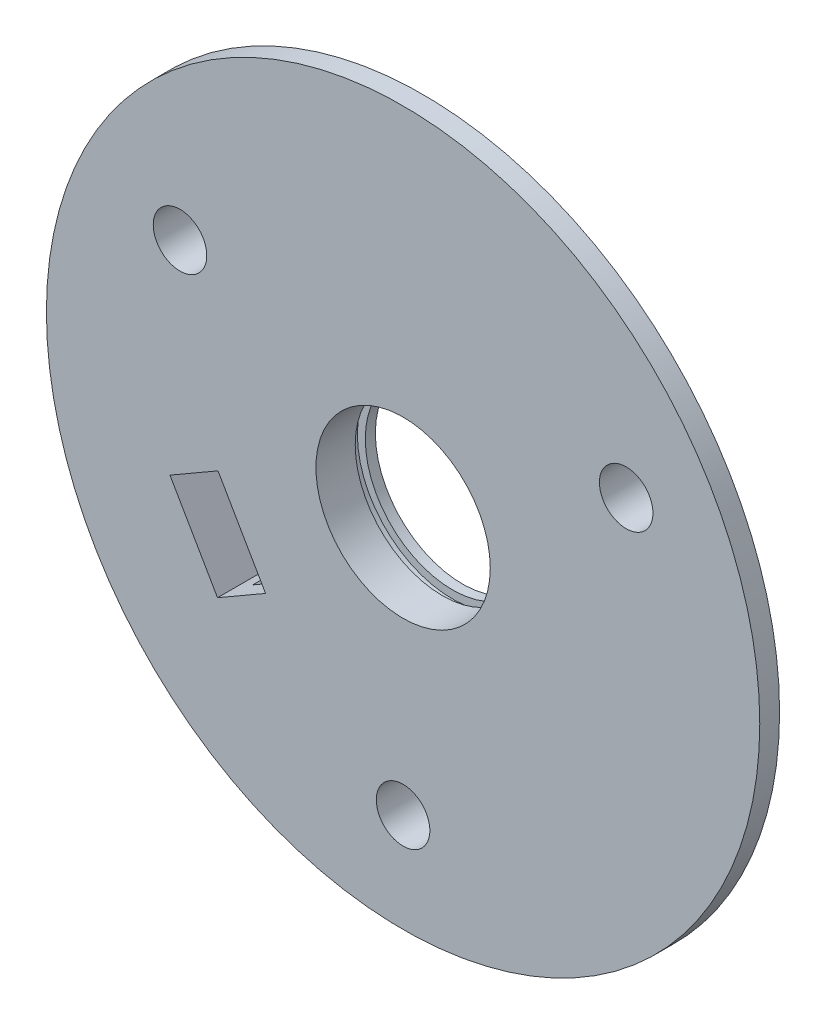
ISO-10303-21;
HEADER;
FILE_DESCRIPTION(('STEP AP214'),'2;1');
FILE_NAME('part.step','',(''),(''),'','','');
FILE_SCHEMA(('AUTOMOTIVE_DESIGN { 1 0 10303 214 1 1 1 1 }'));
ENDSEC;
DATA;
#1=APPLICATION_CONTEXT('core data for automotive mechanical design processes');
#2=APPLICATION_PROTOCOL_DEFINITION('international standard','automotive_design',2000,#1);
#3=PRODUCT_CONTEXT('',#1,'mechanical');
#4=PRODUCT('Part','Part','',(#3));
#5=PRODUCT_RELATED_PRODUCT_CATEGORY('part','',(#4));
#6=PRODUCT_DEFINITION_FORMATION('','',#4);
#7=PRODUCT_DEFINITION_CONTEXT('part definition',#1,'design');
#8=PRODUCT_DEFINITION('design','',#6,#7);
#9=PRODUCT_DEFINITION_SHAPE('','',#8);
#10=(LENGTH_UNIT() NAMED_UNIT(*) SI_UNIT(.MILLI.,.METRE.));
#11=(NAMED_UNIT(*) PLANE_ANGLE_UNIT() SI_UNIT($,.RADIAN.));
#12=(NAMED_UNIT(*) SI_UNIT($,.STERADIAN.) SOLID_ANGLE_UNIT());
#13=UNCERTAINTY_MEASURE_WITH_UNIT(LENGTH_MEASURE(1.E-05),#10,'distance_accuracy_value','');
#14=(GEOMETRIC_REPRESENTATION_CONTEXT(3) GLOBAL_UNCERTAINTY_ASSIGNED_CONTEXT((#13)) GLOBAL_UNIT_ASSIGNED_CONTEXT((#10,
#11,#12)) REPRESENTATION_CONTEXT('',''));
#15=CARTESIAN_POINT('',(0.,0.,0.));
#16=DIRECTION('',(0.,0.,1.));
#17=DIRECTION('',(1.,0.,0.));
#18=AXIS2_PLACEMENT_3D('',#15,#16,#17);
#19=CARTESIAN_POINT('',(0.,0.,2.5));
#20=DIRECTION('',(0.,0.,1.));
#21=DIRECTION('',(1.,0.,0.));
#22=AXIS2_PLACEMENT_3D('',#19,#20,#21);
#23=PLANE('',#22);
#24=DIRECTION('',(0.866025403784441,0.499999999999996,0.));
#25=VECTOR('',#24,1.);
#26=CARTESIAN_POINT('',(-23.4137748154249,-20.4461524227058,2.5));
#27=LINE('',#26,#25);
#28=CARTESIAN_POINT('',(-23.4137748154249,-20.4461524227058,2.5));
#29=VERTEX_POINT('',#28);
#30=CARTESIAN_POINT('',(-17.3515969889346,-16.9461524227063,2.5));
#31=VERTEX_POINT('',#30);
#32=EDGE_CURVE('E177',#29,#31,#27,.T.);
#33=ORIENTED_EDGE('',*,*,#32,.F.);
#34=DIRECTION('',(0.499999999999995,-0.866025403784441,0.));
#35=VECTOR('',#34,1.);
#36=CARTESIAN_POINT('',(-29.4137748154248,-10.0538475772925,2.5));
#37=LINE('',#36,#35);
#38=CARTESIAN_POINT('',(-29.4137748154248,-10.0538475772925,2.5));
#39=VERTEX_POINT('',#38);
#40=EDGE_CURVE('E174',#39,#29,#37,.T.);
#41=ORIENTED_EDGE('',*,*,#40,.F.);
#42=DIRECTION('',(-0.866025403784441,-0.499999999999996,0.));
#43=VECTOR('',#42,1.);
#44=CARTESIAN_POINT('',(-23.3515969889337,-6.55384757729253,2.5));
#45=LINE('',#44,#43);
#46=CARTESIAN_POINT('',(-23.3515969889337,-6.55384757729253,2.5));
#47=VERTEX_POINT('',#46);
#48=EDGE_CURVE('E185',#47,#39,#45,.T.);
#49=ORIENTED_EDGE('',*,*,#48,.F.);
#50=DIRECTION('',(-0.49999999999993,0.866025403784479,0.));
#51=VECTOR('',#50,1.);
#52=CARTESIAN_POINT('',(-17.3515969889346,-16.9461524227063,2.5));
#53=LINE('',#52,#51);
#54=EDGE_CURVE('E181',#31,#47,#53,.T.);
#55=ORIENTED_EDGE('',*,*,#54,.F.);
#56=EDGE_LOOP('',(#33,#41,#49,#55));
#57=FACE_BOUND('',#56,.T.);
#58=CARTESIAN_POINT('',(0.,0.,2.5));
#59=DIRECTION('',(0.,0.,1.));
#60=DIRECTION('',(1.,0.,0.));
#61=AXIS2_PLACEMENT_3D('',#58,#59,#60);
#62=CIRCLE('',#61,45.);
#63=CARTESIAN_POINT('',(45.,0.,2.5));
#64=VERTEX_POINT('',#63);
#65=EDGE_CURVE('E245',#64,#64,#62,.T.);
#66=ORIENTED_EDGE('',*,*,#65,.T.);
#67=EDGE_LOOP('',(#66));
#68=FACE_BOUND('',#67,.T.);
#69=CARTESIAN_POINT('',(0.,0.,2.5));
#70=DIRECTION('',(0.,0.,1.));
#71=DIRECTION('',(1.,0.,0.));
#72=AXIS2_PLACEMENT_3D('',#69,#70,#71);
#73=CIRCLE('',#72,11.);
#74=CARTESIAN_POINT('',(11.,0.,2.5));
#75=VERTEX_POINT('',#74);
#76=EDGE_CURVE('E241',#75,#75,#73,.T.);
#77=ORIENTED_EDGE('',*,*,#76,.F.);
#78=EDGE_LOOP('',(#77));
#79=FACE_BOUND('',#78,.T.);
#80=CARTESIAN_POINT('',(0.,-32.5,2.5));
#81=DIRECTION('',(0.,0.,-1.));
#82=DIRECTION('',(-1.,0.,0.));
#83=AXIS2_PLACEMENT_3D('',#80,#81,#82);
#84=CIRCLE('',#83,3.3782);
#85=CARTESIAN_POINT('',(-3.3782,-32.5,2.5));
#86=VERTEX_POINT('',#85);
#87=EDGE_CURVE('E377',#86,#86,#84,.T.);
#88=ORIENTED_EDGE('',*,*,#87,.T.);
#89=EDGE_LOOP('',(#88));
#90=FACE_BOUND('',#89,.T.);
#91=CARTESIAN_POINT('',(-28.1458256229944,16.2499999999997,2.5));
#92=DIRECTION('',(0.,0.,-1.));
#93=DIRECTION('',(-1.,0.,0.));
#94=AXIS2_PLACEMENT_3D('',#91,#92,#93);
#95=CIRCLE('',#94,3.3782);
#96=CARTESIAN_POINT('',(-31.5240256229944,16.2499999999997,2.5));
#97=VERTEX_POINT('',#96);
#98=EDGE_CURVE('E381',#97,#97,#95,.T.);
#99=ORIENTED_EDGE('',*,*,#98,.T.);
#100=EDGE_LOOP('',(#99));
#101=FACE_BOUND('',#100,.T.);
#102=CARTESIAN_POINT('',(28.1458256229942,16.2500000000001,2.5));
#103=DIRECTION('',(0.,0.,-1.));
#104=DIRECTION('',(-1.,0.,0.));
#105=AXIS2_PLACEMENT_3D('',#102,#103,#104);
#106=CIRCLE('',#105,3.3782);
#107=CARTESIAN_POINT('',(24.7676256229942,16.2500000000001,2.5));
#108=VERTEX_POINT('',#107);
#109=EDGE_CURVE('E384',#108,#108,#106,.T.);
#110=ORIENTED_EDGE('',*,*,#109,.T.);
#111=EDGE_LOOP('',(#110));
#112=FACE_BOUND('',#111,.T.);
#113=ADVANCED_FACE('F46',(#57,#68,#79,#90,#101,#112),#23,.T.);
#114=CARTESIAN_POINT('',(0.,0.,-3.));
#115=DIRECTION('',(0.,0.,-1.));
#116=DIRECTION('',(-1.,0.,0.));
#117=AXIS2_PLACEMENT_3D('',#114,#115,#116);
#118=PLANE('',#117);
#119=CARTESIAN_POINT('',(28.1458256229942,16.2500000000001,-3.));
#120=DIRECTION('',(0.,0.,-1.));
#121=DIRECTION('',(-1.,0.,0.));
#122=AXIS2_PLACEMENT_3D('',#119,#120,#121);
#123=CIRCLE('',#122,3.37819999999999);
#124=CARTESIAN_POINT('',(24.7676256229942,16.2500000000001,-3.));
#125=VERTEX_POINT('',#124);
#126=EDGE_CURVE('E387',#125,#125,#123,.T.);
#127=ORIENTED_EDGE('',*,*,#126,.F.);
#128=EDGE_LOOP('',(#127));
#129=FACE_BOUND('',#128,.T.);
#130=CARTESIAN_POINT('',(-28.1458256229944,16.2499999999997,-3.));
#131=DIRECTION('',(0.,0.,-1.));
#132=DIRECTION('',(-1.,0.,0.));
#133=AXIS2_PLACEMENT_3D('',#130,#131,#132);
#134=CIRCLE('',#133,3.37819999999999);
#135=CARTESIAN_POINT('',(-31.5240256229944,16.2499999999997,-3.));
#136=VERTEX_POINT('',#135);
#137=EDGE_CURVE('E386',#136,#136,#134,.T.);
#138=ORIENTED_EDGE('',*,*,#137,.F.);
#139=EDGE_LOOP('',(#138));
#140=FACE_BOUND('',#139,.T.);
#141=CARTESIAN_POINT('',(0.,-32.5,-3.));
#142=DIRECTION('',(0.,0.,-1.));
#143=DIRECTION('',(-1.,0.,0.));
#144=AXIS2_PLACEMENT_3D('',#141,#142,#143);
#145=CIRCLE('',#144,3.37819999999999);
#146=CARTESIAN_POINT('',(-3.37819999999999,-32.5,-3.));
#147=VERTEX_POINT('',#146);
#148=EDGE_CURVE('E395',#147,#147,#145,.T.);
#149=ORIENTED_EDGE('',*,*,#148,.F.);
#150=EDGE_LOOP('',(#149));
#151=FACE_BOUND('',#150,.T.);
#152=CARTESIAN_POINT('',(-8.32538774695314,-10.2095684567011,-3.));
#153=DIRECTION('',(0.,0.,1.));
#154=DIRECTION('',(-1.,0.,0.));
#155=AXIS2_PLACEMENT_3D('',#152,#153,#154);
#156=CIRCLE('',#155,13.5);
#157=CARTESIAN_POINT('',(-19.3001541474491,-18.071152422706,-3.));
#158=VERTEX_POINT('',#157);
#159=CARTESIAN_POINT('',(-2.4537604244755,-22.3658011208916,-3.));
#160=VERTEX_POINT('',#159);
#161=EDGE_CURVE('E154',#158,#160,#156,.T.);
#162=ORIENTED_EDGE('',*,*,#161,.F.);
#163=DIRECTION('',(0.866025403784441,0.499999999999996,0.));
#164=VECTOR('',#163,1.);
#165=CARTESIAN_POINT('',(-23.4137748154249,-20.4461524227058,-3.));
#166=LINE('',#165,#164);
#167=CARTESIAN_POINT('',(-17.3515969889346,-16.9461524227063,-3.));
#168=VERTEX_POINT('',#167);
#169=EDGE_CURVE('E159',#158,#168,#166,.T.);
#170=ORIENTED_EDGE('',*,*,#169,.T.);
#171=DIRECTION('',(-0.49999999999993,0.866025403784479,0.));
#172=VECTOR('',#171,1.);
#173=CARTESIAN_POINT('',(-17.3515969889346,-16.9461524227063,-3.));
#174=LINE('',#173,#172);
#175=CARTESIAN_POINT('',(-23.3515969889337,-6.55384757729253,-3.));
#176=VERTEX_POINT('',#175);
#177=EDGE_CURVE('E195',#168,#176,#174,.T.);
#178=ORIENTED_EDGE('',*,*,#177,.T.);
#179=DIRECTION('',(-0.866025403784441,-0.499999999999996,0.));
#180=VECTOR('',#179,1.);
#181=CARTESIAN_POINT('',(-23.3515969889337,-6.55384757729253,-3.));
#182=LINE('',#181,#180);
#183=CARTESIAN_POINT('',(-29.4137748154248,-10.0538475772925,-3.));
#184=VERTEX_POINT('',#183);
#185=EDGE_CURVE('E178',#176,#184,#182,.T.);
#186=ORIENTED_EDGE('',*,*,#185,.T.);
#187=DIRECTION('',(0.499999999999995,-0.866025403784441,0.));
#188=VECTOR('',#187,1.);
#189=CARTESIAN_POINT('',(-29.4137748154248,-10.0538475772925,-3.));
#190=LINE('',#189,#188);
#191=CARTESIAN_POINT('',(-23.4137748154249,-20.4461524227058,-3.));
#192=VERTEX_POINT('',#191);
#193=EDGE_CURVE('E173',#184,#192,#190,.T.);
#194=ORIENTED_EDGE('',*,*,#193,.T.);
#195=CARTESIAN_POINT('',(-21.4652176569102,-19.321152422706,-3.));
#196=VERTEX_POINT('',#195);
#197=EDGE_CURVE('E192',#192,#196,#166,.T.);
#198=ORIENTED_EDGE('',*,*,#197,.T.);
#199=CARTESIAN_POINT('',(-8.52217045866901,-9.08750550559468,-3.));
#200=DIRECTION('',(0.,0.,-1.));
#201=DIRECTION('',(-1.,0.,0.));
#202=AXIS2_PLACEMENT_3D('',#199,#200,#201);
#203=CIRCLE('',#202,16.5);
#204=CARTESIAN_POINT('',(1.1272960815018,-22.4717423344215,-3.));
#205=VERTEX_POINT('',#204);
#206=EDGE_CURVE('E400',#205,#196,#203,.T.);
#207=ORIENTED_EDGE('',*,*,#206,.F.);
#208=CARTESIAN_POINT('',(0.,0.,-3.));
#209=DIRECTION('',(0.,0.,-1.));
#210=DIRECTION('',(-1.,0.,0.));
#211=AXIS2_PLACEMENT_3D('',#208,#209,#210);
#212=CIRCLE('',#211,22.5);
#213=EDGE_CURVE('E215',#160,#205,#212,.T.);
#214=ORIENTED_EDGE('',*,*,#213,.F.);
#215=EDGE_LOOP('',(#162,#170,#178,#186,#194,#198,#207,#214));
#216=FACE_BOUND('',#215,.T.);
#217=CARTESIAN_POINT('',(0.,0.,-3.));
#218=DIRECTION('',(0.,0.,-1.));
#219=DIRECTION('',(-1.,0.,0.));
#220=AXIS2_PLACEMENT_3D('',#217,#218,#219);
#221=CIRCLE('',#220,40.);
#222=CARTESIAN_POINT('',(-40.,0.,-3.));
#223=VERTEX_POINT('',#222);
#224=EDGE_CURVE('E219',#223,#223,#221,.T.);
#225=ORIENTED_EDGE('',*,*,#224,.T.);
#226=EDGE_LOOP('',(#225));
#227=FACE_BOUND('',#226,.T.);
#228=ADVANCED_FACE('F307',(#129,#140,#151,#216,#227),#118,.T.);
#229=CARTESIAN_POINT('',(0.,0.,0.));
#230=DIRECTION('',(0.,0.,1.));
#231=DIRECTION('',(1.,0.,0.));
#232=AXIS2_PLACEMENT_3D('',#229,#230,#231);
#233=PLANE('',#232);
#234=CARTESIAN_POINT('',(0.,0.,0.));
#235=DIRECTION('',(0.,0.,1.));
#236=DIRECTION('',(1.,0.,0.));
#237=AXIS2_PLACEMENT_3D('',#234,#235,#236);
#238=CIRCLE('',#237,20.);
#239=CARTESIAN_POINT('',(0.995687557956343,-19.9751997809016,0.));
#240=VERTEX_POINT('',#239);
#241=CARTESIAN_POINT('',(4.24045683198657,-19.5452942125735,0.));
#242=VERTEX_POINT('',#241);
#243=EDGE_CURVE('E270',#240,#242,#238,.F.);
#244=ORIENTED_EDGE('',*,*,#243,.T.);
#245=CARTESIAN_POINT('',(-8.52217045866901,-9.08750550559468,0.));
#246=DIRECTION('',(0.,0.,1.));
#247=DIRECTION('',(1.,0.,0.));
#248=AXIS2_PLACEMENT_3D('',#245,#246,#247);
#249=CIRCLE('',#248,16.5);
#250=CARTESIAN_POINT('',(-21.4652176569102,-19.321152422706,0.));
#251=VERTEX_POINT('',#250);
#252=EDGE_CURVE('E144',#242,#251,#249,.F.);
#253=ORIENTED_EDGE('',*,*,#252,.T.);
#254=DIRECTION('',(0.866025403784439,0.5,0.));
#255=VECTOR('',#254,1.);
#256=CARTESIAN_POINT('',(-19.3001541474491,-18.071152422706,0.));
#257=LINE('',#256,#255);
#258=CARTESIAN_POINT('',(-19.3001541474491,-18.071152422706,0.));
#259=VERTEX_POINT('',#258);
#260=EDGE_CURVE('E147',#251,#259,#257,.T.);
#261=ORIENTED_EDGE('',*,*,#260,.T.);
#262=CARTESIAN_POINT('',(-8.32538774695314,-10.2095684567011,0.));
#263=DIRECTION('',(0.,0.,1.));
#264=DIRECTION('',(1.,0.,0.));
#265=AXIS2_PLACEMENT_3D('',#262,#263,#264);
#266=CIRCLE('',#265,13.5);
#267=EDGE_CURVE('E133',#259,#240,#266,.T.);
#268=ORIENTED_EDGE('',*,*,#267,.T.);
#269=EDGE_LOOP('',(#244,#253,#261,#268));
#270=FACE_BOUND('',#269,.T.);
#271=CARTESIAN_POINT('',(0.,0.,0.));
#272=DIRECTION('',(0.,0.,1.));
#273=DIRECTION('',(1.,0.,0.));
#274=AXIS2_PLACEMENT_3D('',#271,#272,#273);
#275=CIRCLE('',#274,14.5);
#276=CARTESIAN_POINT('',(14.5,0.,0.));
#277=VERTEX_POINT('',#276);
#278=EDGE_CURVE('E266',#277,#277,#275,.T.);
#279=ORIENTED_EDGE('',*,*,#278,.T.);
#280=EDGE_LOOP('',(#279));
#281=FACE_BOUND('',#280,.T.);
#282=ADVANCED_FACE('F148',(#270,#281),#233,.F.);
#283=CARTESIAN_POINT('',(0.,0.,0.));
#284=DIRECTION('',(0.,0.,1.));
#285=DIRECTION('',(1.,0.,0.));
#286=AXIS2_PLACEMENT_3D('',#283,#284,#285);
#287=CYLINDRICAL_SURFACE('',#286,11.);
#288=ORIENTED_EDGE('',*,*,#76,.T.);
#289=EDGE_LOOP('',(#288));
#290=FACE_BOUND('',#289,.T.);
#291=CARTESIAN_POINT('',(0.,0.,-2.46));
#292=DIRECTION('',(0.,0.,-1.));
#293=DIRECTION('',(-1.,0.,0.));
#294=AXIS2_PLACEMENT_3D('',#291,#292,#293);
#295=CIRCLE('',#294,11.);
#296=CARTESIAN_POINT('',(-11.,0.,-2.46));
#297=VERTEX_POINT('',#296);
#298=EDGE_CURVE('E228',#297,#297,#295,.F.);
#299=ORIENTED_EDGE('',*,*,#298,.F.);
#300=EDGE_LOOP('',(#299));
#301=FACE_BOUND('',#300,.T.);
#302=ADVANCED_FACE('F339',(#290,#301),#287,.F.);
#303=CARTESIAN_POINT('',(0.,0.,0.));
#304=DIRECTION('',(0.,0.,1.));
#305=DIRECTION('',(1.,0.,0.));
#306=AXIS2_PLACEMENT_3D('',#303,#304,#305);
#307=CIRCLE('',#306,40.);
#308=CARTESIAN_POINT('',(40.,0.,0.));
#309=VERTEX_POINT('',#308);
#310=EDGE_CURVE('E249',#309,#309,#307,.F.);
#311=ORIENTED_EDGE('',*,*,#310,.F.);
#312=EDGE_LOOP('',(#311));
#313=FACE_BOUND('',#312,.T.);
#314=CARTESIAN_POINT('',(0.,0.,0.));
#315=DIRECTION('',(0.,0.,1.));
#316=DIRECTION('',(1.,0.,0.));
#317=AXIS2_PLACEMENT_3D('',#314,#315,#316);
#318=CIRCLE('',#317,45.);
#319=CARTESIAN_POINT('',(45.,0.,0.));
#320=VERTEX_POINT('',#319);
#321=EDGE_CURVE('E244',#320,#320,#318,.T.);
#322=ORIENTED_EDGE('',*,*,#321,.F.);
#323=EDGE_LOOP('',(#322));
#324=FACE_BOUND('',#323,.T.);
#325=ADVANCED_FACE('F343',(#313,#324),#233,.F.);
#326=CARTESIAN_POINT('',(0.,0.,2.5));
#327=DIRECTION('',(0.,0.,-1.));
#328=DIRECTION('',(-1.,0.,0.));
#329=AXIS2_PLACEMENT_3D('',#326,#327,#328);
#330=CYLINDRICAL_SURFACE('',#329,45.);
#331=ORIENTED_EDGE('',*,*,#65,.F.);
#332=EDGE_LOOP('',(#331));
#333=FACE_BOUND('',#332,.T.);
#334=ORIENTED_EDGE('',*,*,#321,.T.);
#335=EDGE_LOOP('',(#334));
#336=FACE_BOUND('',#335,.T.);
#337=ADVANCED_FACE('F337',(#333,#336),#330,.T.);
#338=CARTESIAN_POINT('',(0.,0.,-3.73));
#339=DIRECTION('',(0.,0.,-1.));
#340=DIRECTION('',(-1.,0.,0.));
#341=AXIS2_PLACEMENT_3D('',#338,#339,#340);
#342=CIRCLE('',#341,11.);
#343=CARTESIAN_POINT('',(-11.,0.,-3.73));
#344=VERTEX_POINT('',#343);
#345=EDGE_CURVE('E237',#344,#344,#342,.F.);
#346=ORIENTED_EDGE('',*,*,#345,.T.);
#347=EDGE_LOOP('',(#346));
#348=FACE_BOUND('',#347,.T.);
#349=CARTESIAN_POINT('',(0.,0.,-5.));
#350=DIRECTION('',(0.,0.,-1.));
#351=DIRECTION('',(-1.,0.,0.));
#352=AXIS2_PLACEMENT_3D('',#349,#350,#351);
#353=CIRCLE('',#352,11.);
#354=CARTESIAN_POINT('',(-11.,0.,-5.));
#355=VERTEX_POINT('',#354);
#356=EDGE_CURVE('E232',#355,#355,#353,.T.);
#357=ORIENTED_EDGE('',*,*,#356,.T.);
#358=EDGE_LOOP('',(#357));
#359=FACE_BOUND('',#358,.T.);
#360=ADVANCED_FACE('F330',(#348,#359),#287,.F.);
#361=CARTESIAN_POINT('',(0.,0.,-5.));
#362=DIRECTION('',(0.,0.,-1.));
#363=DIRECTION('',(-1.,0.,0.));
#364=AXIS2_PLACEMENT_3D('',#361,#362,#363);
#365=PLANE('',#364);
#366=CARTESIAN_POINT('',(0.,0.,-5.));
#367=DIRECTION('',(0.,0.,-1.));
#368=DIRECTION('',(-1.,0.,0.));
#369=AXIS2_PLACEMENT_3D('',#366,#367,#368);
#370=CIRCLE('',#369,13.5);
#371=CARTESIAN_POINT('',(-13.5,0.,-5.));
#372=VERTEX_POINT('',#371);
#373=EDGE_CURVE('E236',#372,#372,#370,.T.);
#374=ORIENTED_EDGE('',*,*,#373,.T.);
#375=EDGE_LOOP('',(#374));
#376=FACE_BOUND('',#375,.T.);
#377=ORIENTED_EDGE('',*,*,#356,.F.);
#378=EDGE_LOOP('',(#377));
#379=FACE_BOUND('',#378,.T.);
#380=ADVANCED_FACE('F327',(#376,#379),#365,.T.);
#381=CARTESIAN_POINT('',(0.,0.,-5.));
#382=DIRECTION('',(0.,0.,1.));
#383=DIRECTION('',(1.,0.,0.));
#384=AXIS2_PLACEMENT_3D('',#381,#382,#383);
#385=CYLINDRICAL_SURFACE('',#384,13.5);
#386=CARTESIAN_POINT('',(0.,0.,-1.));
#387=DIRECTION('',(0.,0.,1.));
#388=DIRECTION('',(1.,0.,0.));
#389=AXIS2_PLACEMENT_3D('',#386,#387,#388);
#390=CIRCLE('',#389,13.5);
#391=CARTESIAN_POINT('',(13.5,0.,-1.));
#392=VERTEX_POINT('',#391);
#393=EDGE_CURVE('E262',#392,#392,#390,.F.);
#394=ORIENTED_EDGE('',*,*,#393,.T.);
#395=EDGE_LOOP('',(#394));
#396=FACE_BOUND('',#395,.T.);
#397=ORIENTED_EDGE('',*,*,#373,.F.);
#398=EDGE_LOOP('',(#397));
#399=FACE_BOUND('',#398,.T.);
#400=ADVANCED_FACE('F319',(#396,#399),#385,.T.);
#401=CARTESIAN_POINT('',(0.,0.,-3.73));
#402=DIRECTION('',(0.,0.,-1.));
#403=DIRECTION('',(-1.,0.,0.));
#404=AXIS2_PLACEMENT_3D('',#401,#402,#403);
#405=PLANE('',#404);
#406=CARTESIAN_POINT('',(0.,0.,-3.73));
#407=DIRECTION('',(0.,0.,-1.));
#408=DIRECTION('',(-1.,0.,0.));
#409=AXIS2_PLACEMENT_3D('',#406,#407,#408);
#410=CIRCLE('',#409,12.);
#411=CARTESIAN_POINT('',(-12.,0.,-3.73));
#412=VERTEX_POINT('',#411);
#413=EDGE_CURVE('E224',#412,#412,#410,.T.);
#414=ORIENTED_EDGE('',*,*,#413,.F.);
#415=EDGE_LOOP('',(#414));
#416=FACE_BOUND('',#415,.T.);
#417=ORIENTED_EDGE('',*,*,#345,.F.);
#418=EDGE_LOOP('',(#417));
#419=FACE_BOUND('',#418,.T.);
#420=ADVANCED_FACE('F315',(#416,#419),#405,.F.);
#421=CARTESIAN_POINT('',(0.,0.,-2.46));
#422=DIRECTION('',(0.,0.,-1.));
#423=DIRECTION('',(-1.,0.,0.));
#424=AXIS2_PLACEMENT_3D('',#421,#422,#423);
#425=PLANE('',#424);
#426=CARTESIAN_POINT('',(0.,0.,-2.46));
#427=DIRECTION('',(0.,0.,-1.));
#428=DIRECTION('',(-1.,0.,0.));
#429=AXIS2_PLACEMENT_3D('',#426,#427,#428);
#430=CIRCLE('',#429,12.);
#431=CARTESIAN_POINT('',(-12.,0.,-2.46));
#432=VERTEX_POINT('',#431);
#433=EDGE_CURVE('E223',#432,#432,#430,.T.);
#434=ORIENTED_EDGE('',*,*,#433,.T.);
#435=EDGE_LOOP('',(#434));
#436=FACE_BOUND('',#435,.T.);
#437=ORIENTED_EDGE('',*,*,#298,.T.);
#438=EDGE_LOOP('',(#437));
#439=FACE_BOUND('',#438,.T.);
#440=ADVANCED_FACE('F318',(#436,#439),#425,.T.);
#441=CARTESIAN_POINT('',(0.,0.,-3.73));
#442=DIRECTION('',(0.,0.,1.));
#443=DIRECTION('',(1.,0.,0.));
#444=AXIS2_PLACEMENT_3D('',#441,#442,#443);
#445=CYLINDRICAL_SURFACE('',#444,12.);
#446=ORIENTED_EDGE('',*,*,#413,.T.);
#447=EDGE_LOOP('',(#446));
#448=FACE_BOUND('',#447,.T.);
#449=ORIENTED_EDGE('',*,*,#433,.F.);
#450=EDGE_LOOP('',(#449));
#451=FACE_BOUND('',#450,.T.);
#452=ADVANCED_FACE('F313',(#448,#451),#445,.F.);
#453=CARTESIAN_POINT('',(0.,0.,-3.));
#454=DIRECTION('',(0.,0.,1.));
#455=DIRECTION('',(1.,0.,0.));
#456=AXIS2_PLACEMENT_3D('',#453,#454,#455);
#457=CYLINDRICAL_SURFACE('',#456,40.);
#458=ORIENTED_EDGE('',*,*,#224,.F.);
#459=EDGE_LOOP('',(#458));
#460=FACE_BOUND('',#459,.T.);
#461=ORIENTED_EDGE('',*,*,#310,.T.);
#462=EDGE_LOOP('',(#461));
#463=FACE_BOUND('',#462,.T.);
#464=ADVANCED_FACE('F306',(#460,#463),#457,.T.);
#465=CARTESIAN_POINT('',(0.,0.,-3.));
#466=DIRECTION('',(0.,0.,1.));
#467=DIRECTION('',(1.,0.,0.));
#468=AXIS2_PLACEMENT_3D('',#465,#466,#467);
#469=CYLINDRICAL_SURFACE('',#468,22.5);
#470=DIRECTION('',(0.,0.,-1.));
#471=VECTOR('',#470,1.);
#472=CARTESIAN_POINT('',(1.12729608150181,-22.4717423344215,-1.5));
#473=LINE('',#472,#471);
#474=CARTESIAN_POINT('',(1.12729608150181,-22.4717423344215,-2.5));
#475=VERTEX_POINT('',#474);
#476=EDGE_CURVE('E169',#475,#205,#473,.T.);
#477=ORIENTED_EDGE('',*,*,#476,.F.);
#478=CARTESIAN_POINT('',(0.,0.,-2.5));
#479=DIRECTION('',(0.,0.,1.));
#480=DIRECTION('',(1.,0.,0.));
#481=AXIS2_PLACEMENT_3D('',#478,#479,#480);
#482=CIRCLE('',#481,22.5);
#483=CARTESIAN_POINT('',(-2.45376042447549,-22.3658011208916,-2.5));
#484=VERTEX_POINT('',#483);
#485=EDGE_CURVE('E73',#475,#484,#482,.T.);
#486=ORIENTED_EDGE('',*,*,#485,.T.);
#487=DIRECTION('',(0.,0.,-1.));
#488=VECTOR('',#487,1.);
#489=CARTESIAN_POINT('',(-2.45376042447549,-22.3658011208916,-1.5));
#490=LINE('',#489,#488);
#491=EDGE_CURVE('E171',#160,#484,#490,.F.);
#492=ORIENTED_EDGE('',*,*,#491,.F.);
#493=ORIENTED_EDGE('',*,*,#213,.T.);
#494=EDGE_LOOP('',(#477,#486,#492,#493));
#495=FACE_BOUND('',#494,.T.);
#496=ADVANCED_FACE('F303',(#495),#469,.F.);
#497=CARTESIAN_POINT('',(0.,0.,-1.));
#498=DIRECTION('',(0.,0.,1.));
#499=DIRECTION('',(1.,0.,0.));
#500=AXIS2_PLACEMENT_3D('',#497,#498,#499);
#501=TOROIDAL_SURFACE('',#500,14.5,1.);
#502=ORIENTED_EDGE('',*,*,#278,.F.);
#503=EDGE_LOOP('',(#502));
#504=FACE_BOUND('',#503,.T.);
#505=ORIENTED_EDGE('',*,*,#393,.F.);
#506=EDGE_LOOP('',(#505));
#507=FACE_BOUND('',#506,.T.);
#508=ADVANCED_FACE('F301',(#504,#507),#501,.F.);
#509=CARTESIAN_POINT('',(-29.4137748154248,-10.0538475772925,2.5));
#510=DIRECTION('',(0.866025403784441,0.499999999999995,0.));
#511=DIRECTION('',(-0.499999999999995,0.866025403784441,0.));
#512=AXIS2_PLACEMENT_3D('',#509,#510,#511);
#513=PLANE('',#512);
#514=ORIENTED_EDGE('',*,*,#193,.F.);
#515=DIRECTION('',(0.,0.,-1.));
#516=VECTOR('',#515,1.);
#517=CARTESIAN_POINT('',(-29.4137748154248,-10.0538475772925,2.5));
#518=LINE('',#517,#516);
#519=EDGE_CURVE('E188',#39,#184,#518,.T.);
#520=ORIENTED_EDGE('',*,*,#519,.F.);
#521=ORIENTED_EDGE('',*,*,#40,.T.);
#522=DIRECTION('',(0.,0.,-1.));
#523=VECTOR('',#522,1.);
#524=CARTESIAN_POINT('',(-23.4137748154249,-20.4461524227058,2.5));
#525=LINE('',#524,#523);
#526=EDGE_CURVE('E211',#29,#192,#525,.T.);
#527=ORIENTED_EDGE('',*,*,#526,.T.);
#528=EDGE_LOOP('',(#514,#520,#521,#527));
#529=FACE_BOUND('',#528,.T.);
#530=ADVANCED_FACE('F298',(#529),#513,.T.);
#531=CARTESIAN_POINT('',(-23.4137748154249,-20.4461524227058,2.5));
#532=DIRECTION('',(-0.499999999999996,0.866025403784441,0.));
#533=DIRECTION('',(-0.866025403784441,-0.499999999999996,0.));
#534=AXIS2_PLACEMENT_3D('',#531,#532,#533);
#535=PLANE('',#534);
#536=DIRECTION('',(0.,0.,-1.));
#537=VECTOR('',#536,1.);
#538=CARTESIAN_POINT('',(-19.3001541474491,-18.071152422706,24.401678108777));
#539=LINE('',#538,#537);
#540=EDGE_CURVE('E137',#259,#158,#539,.T.);
#541=ORIENTED_EDGE('',*,*,#540,.F.);
#542=ORIENTED_EDGE('',*,*,#260,.F.);
#543=DIRECTION('',(0.,0.,-1.));
#544=VECTOR('',#543,1.);
#545=CARTESIAN_POINT('',(-21.4652176569102,-19.321152422706,24.401678108777));
#546=LINE('',#545,#544);
#547=EDGE_CURVE('E166',#251,#196,#546,.T.);
#548=ORIENTED_EDGE('',*,*,#547,.T.);
#549=ORIENTED_EDGE('',*,*,#197,.F.);
#550=ORIENTED_EDGE('',*,*,#526,.F.);
#551=ORIENTED_EDGE('',*,*,#32,.T.);
#552=DIRECTION('',(0.,0.,-1.));
#553=VECTOR('',#552,1.);
#554=CARTESIAN_POINT('',(-17.3515969889346,-16.9461524227063,2.5));
#555=LINE('',#554,#553);
#556=EDGE_CURVE('E208',#31,#168,#555,.T.);
#557=ORIENTED_EDGE('',*,*,#556,.T.);
#558=ORIENTED_EDGE('',*,*,#169,.F.);
#559=EDGE_LOOP('',(#541,#542,#548,#549,#550,#551,#557,#558));
#560=FACE_BOUND('',#559,.T.);
#561=ADVANCED_FACE('F157',(#560),#535,.T.);
#562=CARTESIAN_POINT('',(-17.3515969889346,-16.9461524227063,2.5));
#563=DIRECTION('',(-0.866025403784479,-0.49999999999993,0.));
#564=DIRECTION('',(0.49999999999993,-0.866025403784479,0.));
#565=AXIS2_PLACEMENT_3D('',#562,#563,#564);
#566=PLANE('',#565);
#567=ORIENTED_EDGE('',*,*,#177,.F.);
#568=ORIENTED_EDGE('',*,*,#556,.F.);
#569=ORIENTED_EDGE('',*,*,#54,.T.);
#570=DIRECTION('',(0.,0.,-1.));
#571=VECTOR('',#570,1.);
#572=CARTESIAN_POINT('',(-23.3515969889337,-6.55384757729253,2.5));
#573=LINE('',#572,#571);
#574=EDGE_CURVE('E205',#47,#176,#573,.T.);
#575=ORIENTED_EDGE('',*,*,#574,.T.);
#576=EDGE_LOOP('',(#567,#568,#569,#575));
#577=FACE_BOUND('',#576,.T.);
#578=ADVANCED_FACE('F291',(#577),#566,.T.);
#579=CARTESIAN_POINT('',(-23.3515969889337,-6.55384757729253,2.5));
#580=DIRECTION('',(0.499999999999996,-0.866025403784441,0.));
#581=DIRECTION('',(0.866025403784441,0.499999999999996,0.));
#582=AXIS2_PLACEMENT_3D('',#579,#580,#581);
#583=PLANE('',#582);
#584=ORIENTED_EDGE('',*,*,#185,.F.);
#585=ORIENTED_EDGE('',*,*,#574,.F.);
#586=ORIENTED_EDGE('',*,*,#48,.T.);
#587=ORIENTED_EDGE('',*,*,#519,.T.);
#588=EDGE_LOOP('',(#584,#585,#586,#587));
#589=FACE_BOUND('',#588,.T.);
#590=ADVANCED_FACE('F288',(#589),#583,.T.);
#591=CARTESIAN_POINT('',(-8.32538774695314,-10.2095684567011,24.401678108777));
#592=DIRECTION('',(0.,0.,-1.));
#593=DIRECTION('',(-1.,0.,0.));
#594=AXIS2_PLACEMENT_3D('',#591,#592,#593);
#595=CYLINDRICAL_SURFACE('',#594,13.5);
#596=ORIENTED_EDGE('',*,*,#491,.T.);
#597=CARTESIAN_POINT('',(-2.45376042447549,-22.3658011208916,-2.5));
#598=CARTESIAN_POINT('',(-2.45377135088831,-22.3658050157726,-2.45974137821461));
#599=CARTESIAN_POINT('',(-2.45210872575168,-22.3650034381352,-2.41950437888593));
#600=CARTESIAN_POINT('',(-2.44554335700129,-22.3618295836593,-2.3394005636176));
#601=CARTESIAN_POINT('',(-2.44064411400677,-22.3594590037968,-2.29953339486894));
#602=CARTESIAN_POINT('',(-2.4213933063703,-22.3501227636018,-2.18174635198948));
#603=CARTESIAN_POINT('',(-2.40248332045451,-22.3409305053378,-2.10471233140472));
#604=CARTESIAN_POINT('',(-2.34829208724451,-22.3143371231104,-1.9366053666768));
#605=CARTESIAN_POINT('',(-2.31013591409712,-22.2954770935412,-1.84671364850722));
#606=CARTESIAN_POINT('',(-2.22156796967748,-22.2509908654261,-1.67470571882084));
#607=CARTESIAN_POINT('',(-2.17110013819514,-22.2253336691981,-1.59262753236131));
#608=CARTESIAN_POINT('',(-2.03164033005066,-22.1530913932896,-1.39405460538466));
#609=CARTESIAN_POINT('',(-1.93664901623001,-22.1027240568546,-1.28320252105386));
#610=CARTESIAN_POINT('',(-1.73483342447791,-21.9920955761903,-1.07870235834219));
#611=CARTESIAN_POINT('',(-1.62798464164721,-21.931813813924,-0.985091012504748));
#612=CARTESIAN_POINT('',(-1.4261110708591,-21.8139333464573,-0.827318071053286));
#613=CARTESIAN_POINT('',(-1.33212326487782,-21.7575909073391,-0.760851654564142));
#614=CARTESIAN_POINT('',(-1.1412279125137,-21.6398105132552,-0.637179252921607));
#615=CARTESIAN_POINT('',(-1.04431860923304,-21.5783694515822,-0.579978977432243));
#616=CARTESIAN_POINT('',(-0.848743537293563,-21.4507187406145,-0.474043807034059));
#617=CARTESIAN_POINT('',(-0.750074823450025,-21.3845003906182,-0.425324939151974));
#618=CARTESIAN_POINT('',(-0.55209017111219,-21.2476992504409,-0.33598867809868));
#619=CARTESIAN_POINT('',(-0.452774128402108,-21.1771157411529,-0.295372624449578));
#620=CARTESIAN_POINT('',(-0.238004224025723,-21.0199662791042,-0.215957996929853));
#621=CARTESIAN_POINT('',(-0.122567970295374,-20.9326745743692,-0.178543448232432));
#622=CARTESIAN_POINT('',(0.107209423670073,-20.752936024086,-0.11415292990835));
#623=CARTESIAN_POINT('',(0.22155042399957,-20.660488529971,-0.0871782769603942));
#624=CARTESIAN_POINT('',(0.447451509198998,-20.4715745816061,-0.0439320569059951));
#625=CARTESIAN_POINT('',(0.559026041464338,-20.3751435826735,-0.0275815188950699));
#626=CARTESIAN_POINT('',(0.779525635251158,-20.1781461046256,-0.005634404583658));
#627=CARTESIAN_POINT('',(0.888450953542313,-20.0775800288569,-3.67819446165895E-05));
#628=CARTESIAN_POINT('',(0.995687557956342,-19.9751997809016,0.));
#629=B_SPLINE_CURVE_WITH_KNOTS('',3,(#597,#598,#599,#600,#601,#602,#603,#604,#605,#606,#607,
#608,#609,#610,#611,#612,#613,#614,#615,#616,#617,#618,#619,#620,#621,#622,#623,#624,#625,#626,
#627,#628),.UNSPECIFIED.,.F.,.F.,(4,2,2,2,2,2,2,2,2,2,2,2,2,2,2,4),(0.,0.120693742638401,
0.24125716014551,0.479638194250518,0.776390342924125,1.07451981358029,1.53524029197853,
1.99693128891741,2.38091050650474,2.76512543396504,3.15005869908813,3.53505554707291,
3.98302764481909,4.43105622236893,4.87571522793595,5.3203309626859),.UNSPECIFIED.);
#630=EDGE_CURVE('E12',#484,#240,#629,.T.);
#631=ORIENTED_EDGE('',*,*,#630,.T.);
#632=ORIENTED_EDGE('',*,*,#267,.F.);
#633=ORIENTED_EDGE('',*,*,#540,.T.);
#634=ORIENTED_EDGE('',*,*,#161,.T.);
#635=EDGE_LOOP('',(#596,#631,#632,#633,#634));
#636=FACE_BOUND('',#635,.T.);
#637=ADVANCED_FACE('F135',(#636),#595,.T.);
#638=CARTESIAN_POINT('',(-8.52217045866901,-9.08750550559468,24.401678108777));
#639=DIRECTION('',(0.,0.,-1.));
#640=DIRECTION('',(-1.,0.,0.));
#641=AXIS2_PLACEMENT_3D('',#638,#639,#640);
#642=CYLINDRICAL_SURFACE('',#641,16.5);
#643=ORIENTED_EDGE('',*,*,#252,.F.);
#644=CARTESIAN_POINT('',(4.24045683198657,-19.5452942125735,0.));
#645=CARTESIAN_POINT('',(4.18596160546484,-19.6118010771768,-3.45720409001351E-06));
#646=CARTESIAN_POINT('',(4.13095307484971,-19.6778712672022,-0.00171324853398493));
#647=CARTESIAN_POINT('',(4.0200000133506,-19.8090415825074,-0.00849905922232618));
#648=CARTESIAN_POINT('',(3.96405552043876,-19.8741417469396,-0.0135749423391528));
#649=CARTESIAN_POINT('',(3.79485675276921,-20.067953904058,-0.0337931066836147));
#650=CARTESIAN_POINT('',(3.68032501968495,-20.1950704123537,-0.0539257526525018));
#651=CARTESIAN_POINT('',(3.44764542070314,-20.4454556610475,-0.107667506925285));
#652=CARTESIAN_POINT('',(3.32947253675212,-20.5686716794146,-0.141412486446866));
#653=CARTESIAN_POINT('',(3.09178281884804,-20.8090501993181,-0.222656171880908));
#654=CARTESIAN_POINT('',(2.97226681107322,-20.9262161981034,-0.270146824728289));
#655=CARTESIAN_POINT('',(2.77577054375571,-21.1132222350004,-0.360189485058371));
#656=CARTESIAN_POINT('',(2.69875920910428,-21.1850911182546,-0.398504867556928));
#657=CARTESIAN_POINT('',(2.5452857291773,-21.3256519747264,-0.481509308661889));
#658=CARTESIAN_POINT('',(2.46882345940541,-21.3943446886484,-0.526196871203034));
#659=CARTESIAN_POINT('',(2.31730741559682,-21.5279995410559,-0.622265438469893));
#660=CARTESIAN_POINT('',(2.24225018788364,-21.5929719622695,-0.673626569217571));
#661=CARTESIAN_POINT('',(2.0942255427879,-21.7188781395426,-0.783717402902608));
#662=CARTESIAN_POINT('',(2.02125721736602,-21.7798136660444,-0.842443842536572));
#663=CARTESIAN_POINT('',(1.86134272560496,-21.9111458557031,-0.983186903901309));
#664=CARTESIAN_POINT('',(1.77526711289046,-21.9802823855431,-1.06740529924587));
#665=CARTESIAN_POINT('',(1.61153499000873,-22.1093653189968,-1.2501505705201));
#666=CARTESIAN_POINT('',(1.53387272160958,-22.1693180199594,-1.34866755082475));
#667=CARTESIAN_POINT('',(1.41225703448683,-22.261771604613,-1.53181296931443));
#668=CARTESIAN_POINT('',(1.3649394851075,-22.2972676760592,-1.61266763692306));
#669=CARTESIAN_POINT('',(1.28075086043429,-22.359863131058,-1.78244290247796));
#670=CARTESIAN_POINT('',(1.24383554190812,-22.3869981238644,-1.87132714882557));
#671=CARTESIAN_POINT('',(1.20008194762236,-22.4189757926163,-2.00588940685431));
#672=CARTESIAN_POINT('',(1.18778677657878,-22.4279292832993,-2.0488716917415));
#673=CARTESIAN_POINT('',(1.16639476754698,-22.4434733627864,-2.1360436845925));
#674=CARTESIAN_POINT('',(1.15729684067373,-22.4500647560648,-2.18023297594986));
#675=CARTESIAN_POINT('',(1.14248471707437,-22.4607822403191,-2.27007214062575));
#676=CARTESIAN_POINT('',(1.13681592688887,-22.4648752554533,-2.31573352318299));
#677=CARTESIAN_POINT('',(1.12920790514012,-22.4703639547934,-2.40759094823274));
#678=CARTESIAN_POINT('',(1.12727407609452,-22.4717557317476,-2.45378766812464));
#679=CARTESIAN_POINT('',(1.12729608150181,-22.4717423344215,-2.5));
#680=B_SPLINE_CURVE_WITH_KNOTS('',3,(#644,#645,#646,#647,#648,#649,#650,#651,#652,#653,#654,
#655,#656,#657,#658,#659,#660,#661,#662,#663,#664,#665,#666,#667,#668,#669,#670,#671,#672,#673,
#674,#675,#676,#677,#678,#679),.UNSPECIFIED.,.F.,.F.,(4,2,2,2,2,2,2,2,2,2,2,2,2,2,2,2,2,4),(0.,
0.257902554695207,0.515794671493994,1.03199323106487,1.55347700419679,2.07465587617397,
2.41072872257553,2.74672279505811,3.08173827231706,3.41660583719959,3.83219449458834,
4.24749689489748,4.54713219730396,4.84547314913658,4.98209919177855,5.11867865851116,
5.25702914961432,5.39557961142704),.UNSPECIFIED.);
#681=EDGE_CURVE('E60',#242,#475,#680,.T.);
#682=ORIENTED_EDGE('',*,*,#681,.T.);
#683=ORIENTED_EDGE('',*,*,#476,.T.);
#684=ORIENTED_EDGE('',*,*,#206,.T.);
#685=ORIENTED_EDGE('',*,*,#547,.F.);
#686=EDGE_LOOP('',(#643,#682,#683,#684,#685));
#687=FACE_BOUND('',#686,.T.);
#688=ADVANCED_FACE('F279',(#687),#642,.F.);
#689=CARTESIAN_POINT('',(0.,0.,-2.5));
#690=DIRECTION('',(0.,0.,1.));
#691=DIRECTION('',(1.,0.,0.));
#692=AXIS2_PLACEMENT_3D('',#689,#690,#691);
#693=TOROIDAL_SURFACE('',#692,20.,2.5);
#694=ORIENTED_EDGE('',*,*,#630,.F.);
#695=ORIENTED_EDGE('',*,*,#485,.F.);
#696=ORIENTED_EDGE('',*,*,#681,.F.);
#697=ORIENTED_EDGE('',*,*,#243,.F.);
#698=EDGE_LOOP('',(#694,#695,#696,#697));
#699=FACE_BOUND('',#698,.T.);
#700=ADVANCED_FACE('F48',(#699),#693,.F.);
#701=CARTESIAN_POINT('',(0.,-32.5,-3.));
#702=DIRECTION('',(0.,0.,-1.));
#703=DIRECTION('',(-1.,0.,0.));
#704=AXIS2_PLACEMENT_3D('',#701,#702,#703);
#705=CYLINDRICAL_SURFACE('',#704,3.37819999999999);
#706=ORIENTED_EDGE('',*,*,#87,.F.);
#707=EDGE_LOOP('',(#706));
#708=FACE_BOUND('',#707,.T.);
#709=ORIENTED_EDGE('',*,*,#148,.T.);
#710=EDGE_LOOP('',(#709));
#711=FACE_BOUND('',#710,.T.);
#712=ADVANCED_FACE('F283',(#708,#711),#705,.F.);
#713=CARTESIAN_POINT('',(-28.1458256229944,16.2499999999997,-3.));
#714=DIRECTION('',(0.,0.,-1.));
#715=DIRECTION('',(-1.,0.,0.));
#716=AXIS2_PLACEMENT_3D('',#713,#714,#715);
#717=CYLINDRICAL_SURFACE('',#716,3.37819999999999);
#718=ORIENTED_EDGE('',*,*,#98,.F.);
#719=EDGE_LOOP('',(#718));
#720=FACE_BOUND('',#719,.T.);
#721=ORIENTED_EDGE('',*,*,#137,.T.);
#722=EDGE_LOOP('',(#721));
#723=FACE_BOUND('',#722,.T.);
#724=ADVANCED_FACE('F424',(#720,#723),#717,.F.);
#725=CARTESIAN_POINT('',(28.1458256229942,16.2500000000001,-3.));
#726=DIRECTION('',(0.,0.,-1.));
#727=DIRECTION('',(-1.,0.,0.));
#728=AXIS2_PLACEMENT_3D('',#725,#726,#727);
#729=CYLINDRICAL_SURFACE('',#728,3.37819999999999);
#730=ORIENTED_EDGE('',*,*,#109,.F.);
#731=EDGE_LOOP('',(#730));
#732=FACE_BOUND('',#731,.T.);
#733=ORIENTED_EDGE('',*,*,#126,.T.);
#734=EDGE_LOOP('',(#733));
#735=FACE_BOUND('',#734,.T.);
#736=ADVANCED_FACE('F429',(#732,#735),#729,.F.);
#737=CLOSED_SHELL('',(#113,#228,#282,#302,#325,#337,#360,#380,#400,#420,#440,#452,#464,#496,
#508,#530,#561,#578,#590,#637,#688,#700,#712,#724,#736));
#738=MANIFOLD_SOLID_BREP('B2',#737);
#739=ADVANCED_BREP_SHAPE_REPRESENTATION('',(#18,#738),#14);
#740=SHAPE_DEFINITION_REPRESENTATION(#9,#739);
ENDSEC;
END-ISO-10303-21;
